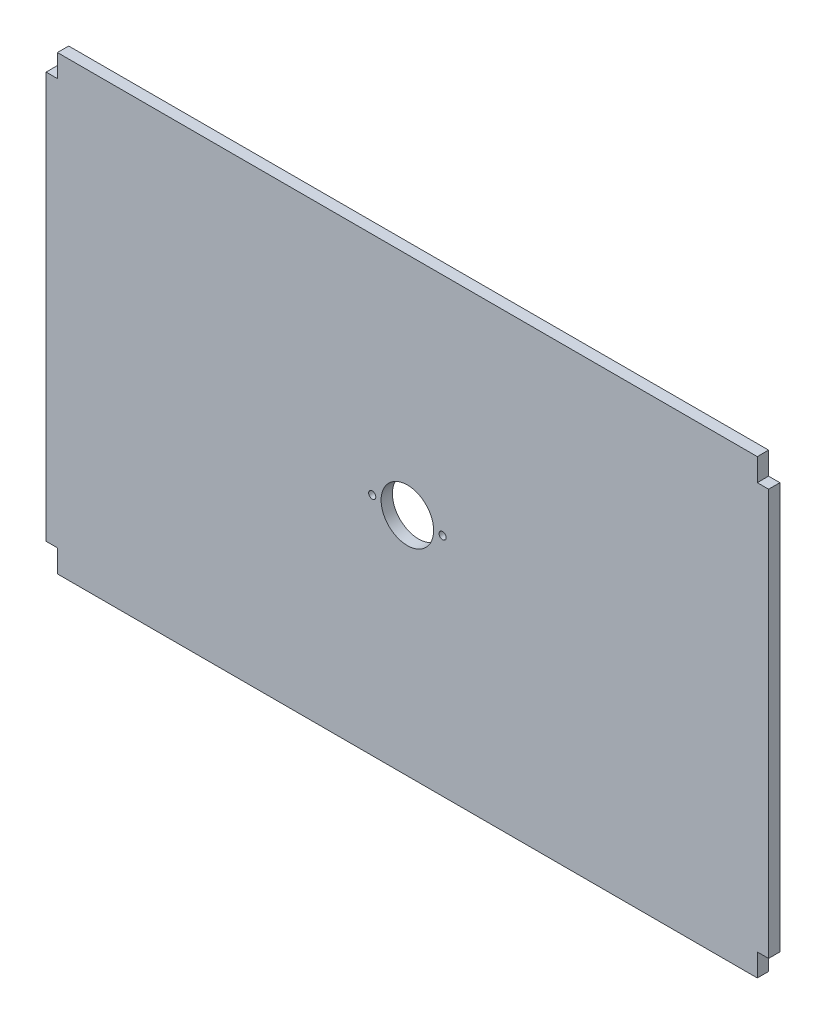
ISO-10303-21;
HEADER;
FILE_DESCRIPTION(('STEP AP214'),'2;1');
FILE_NAME('part.step','',(''),(''),'','','');
FILE_SCHEMA(('AUTOMOTIVE_DESIGN { 1 0 10303 214 1 1 1 1 }'));
ENDSEC;
DATA;
#1=APPLICATION_CONTEXT('core data for automotive mechanical design processes');
#2=APPLICATION_PROTOCOL_DEFINITION('international standard','automotive_design',2000,#1);
#3=PRODUCT_CONTEXT('',#1,'mechanical');
#4=PRODUCT('Part','Part','',(#3));
#5=PRODUCT_RELATED_PRODUCT_CATEGORY('part','',(#4));
#6=PRODUCT_DEFINITION_FORMATION('','',#4);
#7=PRODUCT_DEFINITION_CONTEXT('part definition',#1,'design');
#8=PRODUCT_DEFINITION('design','',#6,#7);
#9=PRODUCT_DEFINITION_SHAPE('','',#8);
#10=(LENGTH_UNIT() NAMED_UNIT(*) SI_UNIT(.MILLI.,.METRE.));
#11=(NAMED_UNIT(*) PLANE_ANGLE_UNIT() SI_UNIT($,.RADIAN.));
#12=(NAMED_UNIT(*) SI_UNIT($,.STERADIAN.) SOLID_ANGLE_UNIT());
#13=UNCERTAINTY_MEASURE_WITH_UNIT(LENGTH_MEASURE(1.E-05),#10,'distance_accuracy_value','');
#14=(GEOMETRIC_REPRESENTATION_CONTEXT(3) GLOBAL_UNCERTAINTY_ASSIGNED_CONTEXT((#13)) GLOBAL_UNIT_ASSIGNED_CONTEXT((#10,
#11,#12)) REPRESENTATION_CONTEXT('',''));
#15=CARTESIAN_POINT('',(0.,0.,0.));
#16=DIRECTION('',(0.,0.,1.));
#17=DIRECTION('',(1.,0.,0.));
#18=AXIS2_PLACEMENT_3D('',#15,#16,#17);
#19=CARTESIAN_POINT('',(0.,0.,3.175));
#20=DIRECTION('',(1.,0.,0.));
#21=DIRECTION('',(0.,0.,-1.));
#22=AXIS2_PLACEMENT_3D('',#19,#20,#21);
#23=PLANE('',#22);
#24=DIRECTION('',(0.,-1.,0.));
#25=VECTOR('',#24,1.);
#26=CARTESIAN_POINT('',(0.,0.,0.));
#27=LINE('',#26,#25);
#28=CARTESIAN_POINT('',(0.,6.35000000000001,0.));
#29=VERTEX_POINT('',#28);
#30=CARTESIAN_POINT('',(0.,0.,0.));
#31=VERTEX_POINT('',#30);
#32=EDGE_CURVE('E154',#29,#31,#27,.T.);
#33=ORIENTED_EDGE('',*,*,#32,.T.);
#34=DIRECTION('',(0.,0.,-1.));
#35=VECTOR('',#34,1.);
#36=CARTESIAN_POINT('',(0.,0.,3.175));
#37=LINE('',#36,#35);
#38=CARTESIAN_POINT('',(0.,0.,3.175));
#39=VERTEX_POINT('',#38);
#40=EDGE_CURVE('E11',#39,#31,#37,.T.);
#41=ORIENTED_EDGE('',*,*,#40,.F.);
#42=DIRECTION('',(0.,-1.,0.));
#43=VECTOR('',#42,1.);
#44=CARTESIAN_POINT('',(0.,0.,3.175));
#45=LINE('',#44,#43);
#46=CARTESIAN_POINT('',(0.,6.35000000000001,3.175));
#47=VERTEX_POINT('',#46);
#48=EDGE_CURVE('E177',#47,#39,#45,.T.);
#49=ORIENTED_EDGE('',*,*,#48,.F.);
#50=DIRECTION('',(0.,0.,-1.));
#51=VECTOR('',#50,1.);
#52=CARTESIAN_POINT('',(0.,6.35000000000001,3.175));
#53=LINE('',#52,#51);
#54=EDGE_CURVE('E150',#47,#29,#53,.T.);
#55=ORIENTED_EDGE('',*,*,#54,.T.);
#56=EDGE_LOOP('',(#33,#41,#49,#55));
#57=FACE_BOUND('',#56,.T.);
#58=ADVANCED_FACE('F34',(#57),#23,.F.);
#59=CARTESIAN_POINT('',(0.,0.,3.175));
#60=DIRECTION('',(0.,1.,0.));
#61=DIRECTION('',(0.,0.,1.));
#62=AXIS2_PLACEMENT_3D('',#59,#60,#61);
#63=PLANE('',#62);
#64=DIRECTION('',(1.,0.,0.));
#65=VECTOR('',#64,1.);
#66=CARTESIAN_POINT('',(0.,0.,0.));
#67=LINE('',#66,#65);
#68=CARTESIAN_POINT('',(196.85,0.,0.));
#69=VERTEX_POINT('',#68);
#70=EDGE_CURVE('E157',#31,#69,#67,.T.);
#71=ORIENTED_EDGE('',*,*,#70,.T.);
#72=DIRECTION('',(0.,0.,-1.));
#73=VECTOR('',#72,1.);
#74=CARTESIAN_POINT('',(196.85,0.,3.175));
#75=LINE('',#74,#73);
#76=CARTESIAN_POINT('',(196.85,0.,3.175));
#77=VERTEX_POINT('',#76);
#78=EDGE_CURVE('E42',#77,#69,#75,.T.);
#79=ORIENTED_EDGE('',*,*,#78,.F.);
#80=DIRECTION('',(1.,0.,0.));
#81=VECTOR('',#80,1.);
#82=CARTESIAN_POINT('',(0.,0.,3.175));
#83=LINE('',#82,#81);
#84=EDGE_CURVE('E105',#39,#77,#83,.T.);
#85=ORIENTED_EDGE('',*,*,#84,.F.);
#86=ORIENTED_EDGE('',*,*,#40,.T.);
#87=EDGE_LOOP('',(#71,#79,#85,#86));
#88=FACE_BOUND('',#87,.T.);
#89=ADVANCED_FACE('F257',(#88),#63,.F.);
#90=CARTESIAN_POINT('',(196.85,0.,3.175));
#91=DIRECTION('',(-1.,0.,0.));
#92=DIRECTION('',(0.,-1.,0.));
#93=AXIS2_PLACEMENT_3D('',#90,#91,#92);
#94=PLANE('',#93);
#95=DIRECTION('',(0.,1.,0.));
#96=VECTOR('',#95,1.);
#97=CARTESIAN_POINT('',(196.85,0.,0.));
#98=LINE('',#97,#96);
#99=CARTESIAN_POINT('',(196.85,6.35000000000001,0.));
#100=VERTEX_POINT('',#99);
#101=EDGE_CURVE('E160',#69,#100,#98,.T.);
#102=ORIENTED_EDGE('',*,*,#101,.T.);
#103=DIRECTION('',(0.,0.,-1.));
#104=VECTOR('',#103,1.);
#105=CARTESIAN_POINT('',(196.85,6.35000000000001,3.175));
#106=LINE('',#105,#104);
#107=CARTESIAN_POINT('',(196.85,6.35000000000001,3.175));
#108=VERTEX_POINT('',#107);
#109=EDGE_CURVE('E196',#108,#100,#106,.T.);
#110=ORIENTED_EDGE('',*,*,#109,.F.);
#111=DIRECTION('',(0.,1.,0.));
#112=VECTOR('',#111,1.);
#113=CARTESIAN_POINT('',(196.85,0.,3.175));
#114=LINE('',#113,#112);
#115=EDGE_CURVE('E204',#77,#108,#114,.T.);
#116=ORIENTED_EDGE('',*,*,#115,.F.);
#117=ORIENTED_EDGE('',*,*,#78,.T.);
#118=EDGE_LOOP('',(#102,#110,#116,#117));
#119=FACE_BOUND('',#118,.T.);
#120=ADVANCED_FACE('F202',(#119),#94,.F.);
#121=CARTESIAN_POINT('',(196.85,6.35000000000001,3.175));
#122=DIRECTION('',(0.,1.,0.));
#123=DIRECTION('',(0.,0.,1.));
#124=AXIS2_PLACEMENT_3D('',#121,#122,#123);
#125=PLANE('',#124);
#126=DIRECTION('',(1.,0.,0.));
#127=VECTOR('',#126,1.);
#128=CARTESIAN_POINT('',(196.85,6.35000000000001,0.));
#129=LINE('',#128,#127);
#130=CARTESIAN_POINT('',(200.025,6.35000000000001,0.));
#131=VERTEX_POINT('',#130);
#132=EDGE_CURVE('E162',#100,#131,#129,.T.);
#133=ORIENTED_EDGE('',*,*,#132,.T.);
#134=DIRECTION('',(0.,0.,-1.));
#135=VECTOR('',#134,1.);
#136=CARTESIAN_POINT('',(200.025,6.35000000000001,3.175));
#137=LINE('',#136,#135);
#138=CARTESIAN_POINT('',(200.025,6.35000000000001,3.175));
#139=VERTEX_POINT('',#138);
#140=EDGE_CURVE('E193',#139,#131,#137,.T.);
#141=ORIENTED_EDGE('',*,*,#140,.F.);
#142=DIRECTION('',(1.,0.,0.));
#143=VECTOR('',#142,1.);
#144=CARTESIAN_POINT('',(196.85,6.35000000000001,3.175));
#145=LINE('',#144,#143);
#146=EDGE_CURVE('E222',#108,#139,#145,.T.);
#147=ORIENTED_EDGE('',*,*,#146,.F.);
#148=ORIENTED_EDGE('',*,*,#109,.T.);
#149=EDGE_LOOP('',(#133,#141,#147,#148));
#150=FACE_BOUND('',#149,.T.);
#151=ADVANCED_FACE('F213',(#150),#125,.F.);
#152=CARTESIAN_POINT('',(200.025,6.35000000000001,3.175));
#153=DIRECTION('',(-1.,0.,0.));
#154=DIRECTION('',(0.,0.,1.));
#155=AXIS2_PLACEMENT_3D('',#152,#153,#154);
#156=PLANE('',#155);
#157=DIRECTION('',(0.,1.,0.));
#158=VECTOR('',#157,1.);
#159=CARTESIAN_POINT('',(200.025,6.35000000000001,0.));
#160=LINE('',#159,#158);
#161=CARTESIAN_POINT('',(200.025,120.65,0.));
#162=VERTEX_POINT('',#161);
#163=EDGE_CURVE('E164',#131,#162,#160,.T.);
#164=ORIENTED_EDGE('',*,*,#163,.T.);
#165=DIRECTION('',(0.,0.,-1.));
#166=VECTOR('',#165,1.);
#167=CARTESIAN_POINT('',(200.025,120.65,3.175));
#168=LINE('',#167,#166);
#169=CARTESIAN_POINT('',(200.025,120.65,3.175));
#170=VERTEX_POINT('',#169);
#171=EDGE_CURVE('E190',#170,#162,#168,.T.);
#172=ORIENTED_EDGE('',*,*,#171,.F.);
#173=DIRECTION('',(0.,1.,0.));
#174=VECTOR('',#173,1.);
#175=CARTESIAN_POINT('',(200.025,6.35000000000001,3.175));
#176=LINE('',#175,#174);
#177=EDGE_CURVE('E219',#139,#170,#176,.T.);
#178=ORIENTED_EDGE('',*,*,#177,.F.);
#179=ORIENTED_EDGE('',*,*,#140,.T.);
#180=EDGE_LOOP('',(#164,#172,#178,#179));
#181=FACE_BOUND('',#180,.T.);
#182=ADVANCED_FACE('F217',(#181),#156,.F.);
#183=CARTESIAN_POINT('',(196.85,120.65,3.175));
#184=DIRECTION('',(0.,-1.,0.));
#185=DIRECTION('',(0.,0.,-1.));
#186=AXIS2_PLACEMENT_3D('',#183,#184,#185);
#187=PLANE('',#186);
#188=DIRECTION('',(-1.,0.,0.));
#189=VECTOR('',#188,1.);
#190=CARTESIAN_POINT('',(196.85,120.65,0.));
#191=LINE('',#190,#189);
#192=CARTESIAN_POINT('',(196.85,120.65,0.));
#193=VERTEX_POINT('',#192);
#194=EDGE_CURVE('E166',#162,#193,#191,.T.);
#195=ORIENTED_EDGE('',*,*,#194,.T.);
#196=DIRECTION('',(0.,0.,-1.));
#197=VECTOR('',#196,1.);
#198=CARTESIAN_POINT('',(196.85,120.65,3.175));
#199=LINE('',#198,#197);
#200=CARTESIAN_POINT('',(196.85,120.65,3.175));
#201=VERTEX_POINT('',#200);
#202=EDGE_CURVE('E187',#201,#193,#199,.T.);
#203=ORIENTED_EDGE('',*,*,#202,.F.);
#204=DIRECTION('',(-1.,0.,0.));
#205=VECTOR('',#204,1.);
#206=CARTESIAN_POINT('',(196.85,120.65,3.175));
#207=LINE('',#206,#205);
#208=EDGE_CURVE('E221',#170,#201,#207,.T.);
#209=ORIENTED_EDGE('',*,*,#208,.F.);
#210=ORIENTED_EDGE('',*,*,#171,.T.);
#211=EDGE_LOOP('',(#195,#203,#209,#210));
#212=FACE_BOUND('',#211,.T.);
#213=ADVANCED_FACE('F270',(#212),#187,.F.);
#214=CARTESIAN_POINT('',(196.85,120.65,3.175));
#215=DIRECTION('',(-1.,0.,0.));
#216=DIRECTION('',(0.,-1.,0.));
#217=AXIS2_PLACEMENT_3D('',#214,#215,#216);
#218=PLANE('',#217);
#219=DIRECTION('',(0.,1.,0.));
#220=VECTOR('',#219,1.);
#221=CARTESIAN_POINT('',(196.85,120.65,0.));
#222=LINE('',#221,#220);
#223=CARTESIAN_POINT('',(196.85,127.,0.));
#224=VERTEX_POINT('',#223);
#225=EDGE_CURVE('E168',#193,#224,#222,.T.);
#226=ORIENTED_EDGE('',*,*,#225,.T.);
#227=DIRECTION('',(0.,0.,-1.));
#228=VECTOR('',#227,1.);
#229=CARTESIAN_POINT('',(196.85,127.,3.175));
#230=LINE('',#229,#228);
#231=CARTESIAN_POINT('',(196.85,127.,3.175));
#232=VERTEX_POINT('',#231);
#233=EDGE_CURVE('E184',#232,#224,#230,.T.);
#234=ORIENTED_EDGE('',*,*,#233,.F.);
#235=DIRECTION('',(0.,1.,0.));
#236=VECTOR('',#235,1.);
#237=CARTESIAN_POINT('',(196.85,120.65,3.175));
#238=LINE('',#237,#236);
#239=EDGE_CURVE('E224',#201,#232,#238,.T.);
#240=ORIENTED_EDGE('',*,*,#239,.F.);
#241=ORIENTED_EDGE('',*,*,#202,.T.);
#242=EDGE_LOOP('',(#226,#234,#240,#241));
#243=FACE_BOUND('',#242,.T.);
#244=ADVANCED_FACE('F273',(#243),#218,.F.);
#245=CARTESIAN_POINT('',(0.,127.,3.175));
#246=DIRECTION('',(0.,-1.,0.));
#247=DIRECTION('',(0.,0.,-1.));
#248=AXIS2_PLACEMENT_3D('',#245,#246,#247);
#249=PLANE('',#248);
#250=DIRECTION('',(-1.,0.,0.));
#251=VECTOR('',#250,1.);
#252=CARTESIAN_POINT('',(0.,127.,0.));
#253=LINE('',#252,#251);
#254=CARTESIAN_POINT('',(0.,127.,0.));
#255=VERTEX_POINT('',#254);
#256=EDGE_CURVE('E170',#224,#255,#253,.T.);
#257=ORIENTED_EDGE('',*,*,#256,.T.);
#258=DIRECTION('',(0.,0.,-1.));
#259=VECTOR('',#258,1.);
#260=CARTESIAN_POINT('',(0.,127.,3.175));
#261=LINE('',#260,#259);
#262=CARTESIAN_POINT('',(0.,127.,3.175));
#263=VERTEX_POINT('',#262);
#264=EDGE_CURVE('E181',#263,#255,#261,.T.);
#265=ORIENTED_EDGE('',*,*,#264,.F.);
#266=DIRECTION('',(-1.,0.,0.));
#267=VECTOR('',#266,1.);
#268=CARTESIAN_POINT('',(0.,127.,3.175));
#269=LINE('',#268,#267);
#270=EDGE_CURVE('E230',#232,#263,#269,.T.);
#271=ORIENTED_EDGE('',*,*,#270,.F.);
#272=ORIENTED_EDGE('',*,*,#233,.T.);
#273=EDGE_LOOP('',(#257,#265,#271,#272));
#274=FACE_BOUND('',#273,.T.);
#275=ADVANCED_FACE('F236',(#274),#249,.F.);
#276=CARTESIAN_POINT('',(0.,120.65,3.175));
#277=DIRECTION('',(1.,0.,0.));
#278=DIRECTION('',(0.,0.,-1.));
#279=AXIS2_PLACEMENT_3D('',#276,#277,#278);
#280=PLANE('',#279);
#281=DIRECTION('',(0.,-1.,0.));
#282=VECTOR('',#281,1.);
#283=CARTESIAN_POINT('',(0.,120.65,0.));
#284=LINE('',#283,#282);
#285=CARTESIAN_POINT('',(0.,120.65,0.));
#286=VERTEX_POINT('',#285);
#287=EDGE_CURVE('E172',#255,#286,#284,.T.);
#288=ORIENTED_EDGE('',*,*,#287,.T.);
#289=DIRECTION('',(0.,0.,-1.));
#290=VECTOR('',#289,1.);
#291=CARTESIAN_POINT('',(0.,120.65,3.175));
#292=LINE('',#291,#290);
#293=CARTESIAN_POINT('',(0.,120.65,3.175));
#294=VERTEX_POINT('',#293);
#295=EDGE_CURVE('E145',#294,#286,#292,.T.);
#296=ORIENTED_EDGE('',*,*,#295,.F.);
#297=DIRECTION('',(0.,-1.,0.));
#298=VECTOR('',#297,1.);
#299=CARTESIAN_POINT('',(0.,120.65,3.175));
#300=LINE('',#299,#298);
#301=EDGE_CURVE('E136',#263,#294,#300,.T.);
#302=ORIENTED_EDGE('',*,*,#301,.F.);
#303=ORIENTED_EDGE('',*,*,#264,.T.);
#304=EDGE_LOOP('',(#288,#296,#302,#303));
#305=FACE_BOUND('',#304,.T.);
#306=ADVANCED_FACE('F240',(#305),#280,.F.);
#307=CARTESIAN_POINT('',(0.,120.65,3.175));
#308=DIRECTION('',(0.,-1.,0.));
#309=DIRECTION('',(0.,0.,-1.));
#310=AXIS2_PLACEMENT_3D('',#307,#308,#309);
#311=PLANE('',#310);
#312=DIRECTION('',(-1.,0.,0.));
#313=VECTOR('',#312,1.);
#314=CARTESIAN_POINT('',(0.,120.65,0.));
#315=LINE('',#314,#313);
#316=CARTESIAN_POINT('',(-3.175,120.65,0.));
#317=VERTEX_POINT('',#316);
#318=EDGE_CURVE('E144',#286,#317,#315,.T.);
#319=ORIENTED_EDGE('',*,*,#318,.T.);
#320=DIRECTION('',(0.,0.,-1.));
#321=VECTOR('',#320,1.);
#322=CARTESIAN_POINT('',(-3.175,120.65,3.175));
#323=LINE('',#322,#321);
#324=CARTESIAN_POINT('',(-3.175,120.65,3.175));
#325=VERTEX_POINT('',#324);
#326=EDGE_CURVE('E141',#325,#317,#323,.T.);
#327=ORIENTED_EDGE('',*,*,#326,.F.);
#328=DIRECTION('',(-1.,0.,0.));
#329=VECTOR('',#328,1.);
#330=CARTESIAN_POINT('',(0.,120.65,3.175));
#331=LINE('',#330,#329);
#332=EDGE_CURVE('E130',#294,#325,#331,.T.);
#333=ORIENTED_EDGE('',*,*,#332,.F.);
#334=ORIENTED_EDGE('',*,*,#295,.T.);
#335=EDGE_LOOP('',(#319,#327,#333,#334));
#336=FACE_BOUND('',#335,.T.);
#337=ADVANCED_FACE('F142',(#336),#311,.F.);
#338=CARTESIAN_POINT('',(-3.175,6.35000000000001,3.175));
#339=DIRECTION('',(1.,0.,0.));
#340=DIRECTION('',(0.,1.,0.));
#341=AXIS2_PLACEMENT_3D('',#338,#339,#340);
#342=PLANE('',#341);
#343=DIRECTION('',(0.,-1.,0.));
#344=VECTOR('',#343,1.);
#345=CARTESIAN_POINT('',(-3.175,6.35000000000001,0.));
#346=LINE('',#345,#344);
#347=CARTESIAN_POINT('',(-3.175,6.35000000000001,0.));
#348=VERTEX_POINT('',#347);
#349=EDGE_CURVE('E91',#317,#348,#346,.T.);
#350=ORIENTED_EDGE('',*,*,#349,.T.);
#351=DIRECTION('',(0.,0.,-1.));
#352=VECTOR('',#351,1.);
#353=CARTESIAN_POINT('',(-3.175,6.35000000000001,3.175));
#354=LINE('',#353,#352);
#355=CARTESIAN_POINT('',(-3.175,6.35000000000001,3.175));
#356=VERTEX_POINT('',#355);
#357=EDGE_CURVE('E146',#356,#348,#354,.T.);
#358=ORIENTED_EDGE('',*,*,#357,.F.);
#359=DIRECTION('',(0.,-1.,0.));
#360=VECTOR('',#359,1.);
#361=CARTESIAN_POINT('',(-3.175,6.35000000000001,3.175));
#362=LINE('',#361,#360);
#363=EDGE_CURVE('E134',#325,#356,#362,.T.);
#364=ORIENTED_EDGE('',*,*,#363,.F.);
#365=ORIENTED_EDGE('',*,*,#326,.T.);
#366=EDGE_LOOP('',(#350,#358,#364,#365));
#367=FACE_BOUND('',#366,.T.);
#368=ADVANCED_FACE('F148',(#367),#342,.F.);
#369=CARTESIAN_POINT('',(0.,6.35000000000001,3.175));
#370=DIRECTION('',(0.,1.,0.));
#371=DIRECTION('',(0.,0.,1.));
#372=AXIS2_PLACEMENT_3D('',#369,#370,#371);
#373=PLANE('',#372);
#374=DIRECTION('',(1.,0.,0.));
#375=VECTOR('',#374,1.);
#376=CARTESIAN_POINT('',(0.,6.35000000000001,0.));
#377=LINE('',#376,#375);
#378=EDGE_CURVE('E97',#348,#29,#377,.T.);
#379=ORIENTED_EDGE('',*,*,#378,.T.);
#380=ORIENTED_EDGE('',*,*,#54,.F.);
#381=DIRECTION('',(1.,0.,0.));
#382=VECTOR('',#381,1.);
#383=CARTESIAN_POINT('',(0.,6.35000000000001,3.175));
#384=LINE('',#383,#382);
#385=EDGE_CURVE('E50',#356,#47,#384,.T.);
#386=ORIENTED_EDGE('',*,*,#385,.F.);
#387=ORIENTED_EDGE('',*,*,#357,.T.);
#388=EDGE_LOOP('',(#379,#380,#386,#387));
#389=FACE_BOUND('',#388,.T.);
#390=ADVANCED_FACE('F244',(#389),#373,.F.);
#391=CARTESIAN_POINT('',(0.,0.,3.175));
#392=DIRECTION('',(0.,0.,1.));
#393=DIRECTION('',(1.,0.,0.));
#394=AXIS2_PLACEMENT_3D('',#391,#392,#393);
#395=PLANE('',#394);
#396=CARTESIAN_POINT('',(108.357,63.5,3.175));
#397=DIRECTION('',(0.,0.,1.));
#398=DIRECTION('',(1.,0.,0.));
#399=AXIS2_PLACEMENT_3D('',#396,#397,#398);
#400=CIRCLE('',#399,0.999999999999998);
#401=CARTESIAN_POINT('',(109.357,63.5,3.175));
#402=VERTEX_POINT('',#401);
#403=EDGE_CURVE('E344',#402,#402,#400,.T.);
#404=ORIENTED_EDGE('',*,*,#403,.F.);
#405=EDGE_LOOP('',(#404));
#406=FACE_BOUND('',#405,.T.);
#407=CARTESIAN_POINT('',(88.545,63.5,3.175));
#408=DIRECTION('',(0.,0.,1.));
#409=DIRECTION('',(1.,0.,0.));
#410=AXIS2_PLACEMENT_3D('',#407,#408,#409);
#411=CIRCLE('',#410,0.999999999999998);
#412=CARTESIAN_POINT('',(89.545,63.5,3.175));
#413=VERTEX_POINT('',#412);
#414=EDGE_CURVE('E346',#413,#413,#411,.T.);
#415=ORIENTED_EDGE('',*,*,#414,.F.);
#416=EDGE_LOOP('',(#415));
#417=FACE_BOUND('',#416,.T.);
#418=CARTESIAN_POINT('',(98.425,63.5,3.175));
#419=DIRECTION('',(0.,0.,1.));
#420=DIRECTION('',(1.,0.,0.));
#421=AXIS2_PLACEMENT_3D('',#418,#419,#420);
#422=CIRCLE('',#421,7.39000000000001);
#423=CARTESIAN_POINT('',(105.815,63.5,3.175));
#424=VERTEX_POINT('',#423);
#425=EDGE_CURVE('E352',#424,#424,#422,.T.);
#426=ORIENTED_EDGE('',*,*,#425,.F.);
#427=EDGE_LOOP('',(#426));
#428=FACE_BOUND('',#427,.T.);
#429=ORIENTED_EDGE('',*,*,#48,.T.);
#430=ORIENTED_EDGE('',*,*,#84,.T.);
#431=ORIENTED_EDGE('',*,*,#115,.T.);
#432=ORIENTED_EDGE('',*,*,#146,.T.);
#433=ORIENTED_EDGE('',*,*,#177,.T.);
#434=ORIENTED_EDGE('',*,*,#208,.T.);
#435=ORIENTED_EDGE('',*,*,#239,.T.);
#436=ORIENTED_EDGE('',*,*,#270,.T.);
#437=ORIENTED_EDGE('',*,*,#301,.T.);
#438=ORIENTED_EDGE('',*,*,#332,.T.);
#439=ORIENTED_EDGE('',*,*,#363,.T.);
#440=ORIENTED_EDGE('',*,*,#385,.T.);
#441=EDGE_LOOP('',(#429,#430,#431,#432,#433,#434,#435,#436,#437,#438,#439,#440));
#442=FACE_BOUND('',#441,.T.);
#443=ADVANCED_FACE('F132',(#406,#417,#428,#442),#395,.T.);
#444=CARTESIAN_POINT('',(0.,0.,0.));
#445=DIRECTION('',(0.,0.,1.));
#446=DIRECTION('',(1.,0.,0.));
#447=AXIS2_PLACEMENT_3D('',#444,#445,#446);
#448=PLANE('',#447);
#449=CARTESIAN_POINT('',(108.357,63.5,0.));
#450=DIRECTION('',(0.,0.,1.));
#451=DIRECTION('',(1.,0.,0.));
#452=AXIS2_PLACEMENT_3D('',#449,#450,#451);
#453=CIRCLE('',#452,0.999999999999998);
#454=CARTESIAN_POINT('',(109.357,63.5,0.));
#455=VERTEX_POINT('',#454);
#456=EDGE_CURVE('E341',#455,#455,#453,.T.);
#457=ORIENTED_EDGE('',*,*,#456,.T.);
#458=EDGE_LOOP('',(#457));
#459=FACE_BOUND('',#458,.T.);
#460=CARTESIAN_POINT('',(88.545,63.5,0.));
#461=DIRECTION('',(0.,0.,1.));
#462=DIRECTION('',(1.,0.,0.));
#463=AXIS2_PLACEMENT_3D('',#460,#461,#462);
#464=CIRCLE('',#463,0.999999999999998);
#465=CARTESIAN_POINT('',(89.545,63.5,0.));
#466=VERTEX_POINT('',#465);
#467=EDGE_CURVE('E355',#466,#466,#464,.T.);
#468=ORIENTED_EDGE('',*,*,#467,.T.);
#469=EDGE_LOOP('',(#468));
#470=FACE_BOUND('',#469,.T.);
#471=CARTESIAN_POINT('',(98.425,63.5,0.));
#472=DIRECTION('',(0.,0.,1.));
#473=DIRECTION('',(1.,0.,0.));
#474=AXIS2_PLACEMENT_3D('',#471,#472,#473);
#475=CIRCLE('',#474,7.39000000000001);
#476=CARTESIAN_POINT('',(105.815,63.5,0.));
#477=VERTEX_POINT('',#476);
#478=EDGE_CURVE('E158',#477,#477,#475,.T.);
#479=ORIENTED_EDGE('',*,*,#478,.T.);
#480=EDGE_LOOP('',(#479));
#481=FACE_BOUND('',#480,.T.);
#482=ORIENTED_EDGE('',*,*,#32,.F.);
#483=ORIENTED_EDGE('',*,*,#378,.F.);
#484=ORIENTED_EDGE('',*,*,#349,.F.);
#485=ORIENTED_EDGE('',*,*,#318,.F.);
#486=ORIENTED_EDGE('',*,*,#287,.F.);
#487=ORIENTED_EDGE('',*,*,#256,.F.);
#488=ORIENTED_EDGE('',*,*,#225,.F.);
#489=ORIENTED_EDGE('',*,*,#194,.F.);
#490=ORIENTED_EDGE('',*,*,#163,.F.);
#491=ORIENTED_EDGE('',*,*,#132,.F.);
#492=ORIENTED_EDGE('',*,*,#101,.F.);
#493=ORIENTED_EDGE('',*,*,#70,.F.);
#494=EDGE_LOOP('',(#482,#483,#484,#485,#486,#487,#488,#489,#490,#491,#492,#493));
#495=FACE_BOUND('',#494,.T.);
#496=ADVANCED_FACE('F208',(#459,#470,#481,#495),#448,.F.);
#497=CARTESIAN_POINT('',(98.425,63.5,0.));
#498=DIRECTION('',(0.,0.,1.));
#499=DIRECTION('',(1.,0.,0.));
#500=AXIS2_PLACEMENT_3D('',#497,#498,#499);
#501=CYLINDRICAL_SURFACE('',#500,7.39000000000001);
#502=ORIENTED_EDGE('',*,*,#478,.F.);
#503=EDGE_LOOP('',(#502));
#504=FACE_BOUND('',#503,.T.);
#505=ORIENTED_EDGE('',*,*,#425,.T.);
#506=EDGE_LOOP('',(#505));
#507=FACE_BOUND('',#506,.T.);
#508=ADVANCED_FACE('F306',(#504,#507),#501,.F.);
#509=CARTESIAN_POINT('',(88.545,63.5,0.));
#510=DIRECTION('',(0.,0.,1.));
#511=DIRECTION('',(1.,0.,0.));
#512=AXIS2_PLACEMENT_3D('',#509,#510,#511);
#513=CYLINDRICAL_SURFACE('',#512,0.999999999999998);
#514=ORIENTED_EDGE('',*,*,#467,.F.);
#515=EDGE_LOOP('',(#514));
#516=FACE_BOUND('',#515,.T.);
#517=ORIENTED_EDGE('',*,*,#414,.T.);
#518=EDGE_LOOP('',(#517));
#519=FACE_BOUND('',#518,.T.);
#520=ADVANCED_FACE('F314',(#516,#519),#513,.F.);
#521=CARTESIAN_POINT('',(108.357,63.5,0.));
#522=DIRECTION('',(0.,0.,1.));
#523=DIRECTION('',(1.,0.,0.));
#524=AXIS2_PLACEMENT_3D('',#521,#522,#523);
#525=CYLINDRICAL_SURFACE('',#524,0.999999999999998);
#526=ORIENTED_EDGE('',*,*,#456,.F.);
#527=EDGE_LOOP('',(#526));
#528=FACE_BOUND('',#527,.T.);
#529=ORIENTED_EDGE('',*,*,#403,.T.);
#530=EDGE_LOOP('',(#529));
#531=FACE_BOUND('',#530,.T.);
#532=ADVANCED_FACE('F324',(#528,#531),#525,.F.);
#533=CLOSED_SHELL('',(#58,#89,#120,#151,#182,#213,#244,#275,#306,#337,#368,#390,#443,#496,#508,
#520,#532));
#534=MANIFOLD_SOLID_BREP('B2',#533);
#535=ADVANCED_BREP_SHAPE_REPRESENTATION('',(#18,#534),#14);
#536=SHAPE_DEFINITION_REPRESENTATION(#9,#535);
ENDSEC;
END-ISO-10303-21;
